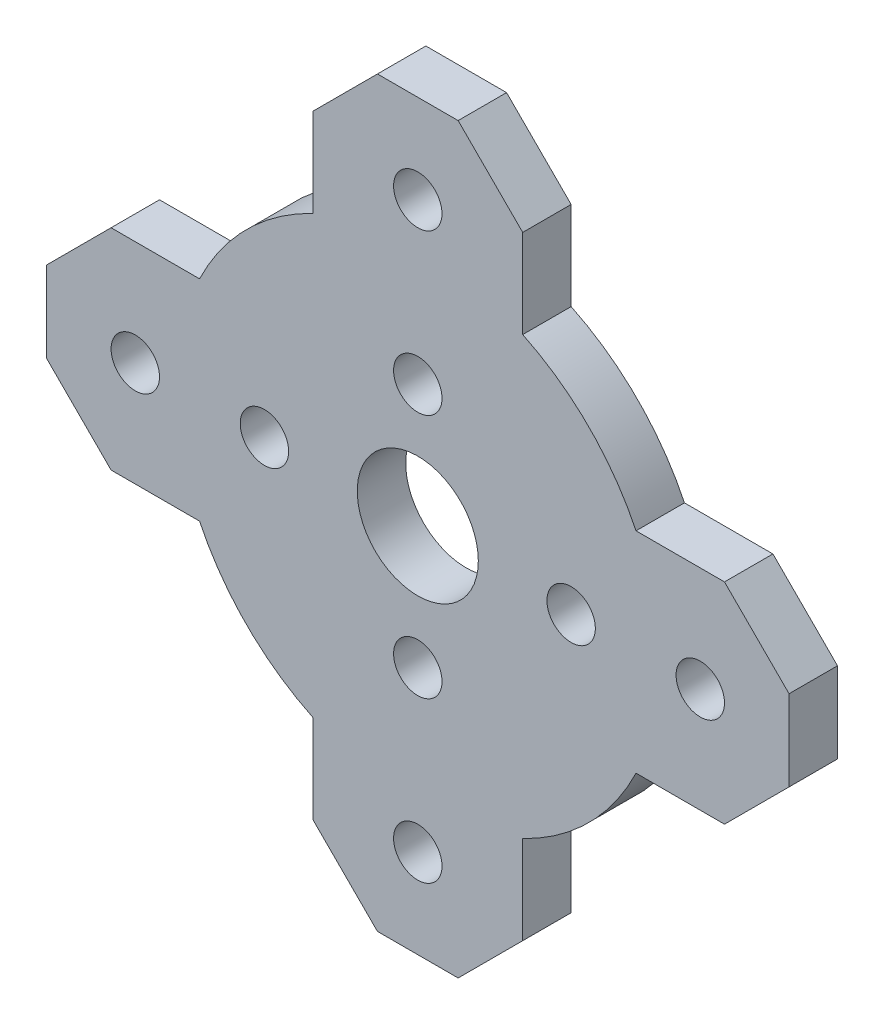
ISO-10303-21;
HEADER;
FILE_DESCRIPTION(('STEP AP214'),'2;1');
FILE_NAME('part.step','',(''),(''),'','','');
FILE_SCHEMA(('AUTOMOTIVE_DESIGN { 1 0 10303 214 1 1 1 1 }'));
ENDSEC;
DATA;
#1=APPLICATION_CONTEXT('core data for automotive mechanical design processes');
#2=APPLICATION_PROTOCOL_DEFINITION('international standard','automotive_design',2000,#1);
#3=PRODUCT_CONTEXT('',#1,'mechanical');
#4=PRODUCT('Part','Part','',(#3));
#5=PRODUCT_RELATED_PRODUCT_CATEGORY('part','',(#4));
#6=PRODUCT_DEFINITION_FORMATION('','',#4);
#7=PRODUCT_DEFINITION_CONTEXT('part definition',#1,'design');
#8=PRODUCT_DEFINITION('design','',#6,#7);
#9=PRODUCT_DEFINITION_SHAPE('','',#8);
#10=(LENGTH_UNIT() NAMED_UNIT(*) SI_UNIT(.MILLI.,.METRE.));
#11=(NAMED_UNIT(*) PLANE_ANGLE_UNIT() SI_UNIT($,.RADIAN.));
#12=(NAMED_UNIT(*) SI_UNIT($,.STERADIAN.) SOLID_ANGLE_UNIT());
#13=UNCERTAINTY_MEASURE_WITH_UNIT(LENGTH_MEASURE(1.E-05),#10,'distance_accuracy_value','');
#14=(GEOMETRIC_REPRESENTATION_CONTEXT(3) GLOBAL_UNCERTAINTY_ASSIGNED_CONTEXT((#13)) GLOBAL_UNIT_ASSIGNED_CONTEXT((#10,
#11,#12)) REPRESENTATION_CONTEXT('',''));
#15=CARTESIAN_POINT('',(0.,0.,0.));
#16=DIRECTION('',(0.,0.,1.));
#17=DIRECTION('',(1.,0.,0.));
#18=AXIS2_PLACEMENT_3D('',#15,#16,#17);
#19=CARTESIAN_POINT('',(0.,0.,3.));
#20=DIRECTION('',(0.,0.,1.));
#21=DIRECTION('',(1.,0.,0.));
#22=AXIS2_PLACEMENT_3D('',#19,#20,#21);
#23=PLANE('',#22);
#24=CARTESIAN_POINT('',(-17.5,0.,3.));
#25=DIRECTION('',(0.,0.,1.));
#26=DIRECTION('',(1.,0.,0.));
#27=AXIS2_PLACEMENT_3D('',#24,#25,#26);
#28=CIRCLE('',#27,1.5);
#29=CARTESIAN_POINT('',(-16.,0.,3.));
#30=VERTEX_POINT('',#29);
#31=EDGE_CURVE('E442',#30,#30,#28,.T.);
#32=ORIENTED_EDGE('',*,*,#31,.F.);
#33=EDGE_LOOP('',(#32));
#34=FACE_BOUND('',#33,.T.);
#35=CARTESIAN_POINT('',(17.5,0.,3.));
#36=DIRECTION('',(0.,0.,1.));
#37=DIRECTION('',(1.,0.,0.));
#38=AXIS2_PLACEMENT_3D('',#35,#36,#37);
#39=CIRCLE('',#38,1.5);
#40=CARTESIAN_POINT('',(19.,0.,3.));
#41=VERTEX_POINT('',#40);
#42=EDGE_CURVE('E430',#41,#41,#39,.T.);
#43=ORIENTED_EDGE('',*,*,#42,.F.);
#44=EDGE_LOOP('',(#43));
#45=FACE_BOUND('',#44,.T.);
#46=CARTESIAN_POINT('',(0.,-7.6,3.));
#47=DIRECTION('',(0.,0.,1.));
#48=DIRECTION('',(1.,0.,0.));
#49=AXIS2_PLACEMENT_3D('',#46,#47,#48);
#50=CIRCLE('',#49,1.5);
#51=CARTESIAN_POINT('',(1.50000000000001,-7.6,3.));
#52=VERTEX_POINT('',#51);
#53=EDGE_CURVE('E418',#52,#52,#50,.T.);
#54=ORIENTED_EDGE('',*,*,#53,.F.);
#55=EDGE_LOOP('',(#54));
#56=FACE_BOUND('',#55,.T.);
#57=CARTESIAN_POINT('',(9.50000000000001,0.,3.));
#58=DIRECTION('',(0.,0.,1.));
#59=DIRECTION('',(1.,0.,0.));
#60=AXIS2_PLACEMENT_3D('',#57,#58,#59);
#61=CIRCLE('',#60,1.5);
#62=CARTESIAN_POINT('',(11.,0.,3.));
#63=VERTEX_POINT('',#62);
#64=EDGE_CURVE('E406',#63,#63,#61,.T.);
#65=ORIENTED_EDGE('',*,*,#64,.F.);
#66=EDGE_LOOP('',(#65));
#67=FACE_BOUND('',#66,.T.);
#68=DIRECTION('',(-1.,0.,0.));
#69=VECTOR('',#68,1.);
#70=CARTESIAN_POINT('',(-23.,6.5,3.));
#71=LINE('',#70,#69);
#72=CARTESIAN_POINT('',(-13.5185058345958,6.5,3.));
#73=VERTEX_POINT('',#72);
#74=CARTESIAN_POINT('',(-19.,6.5,3.));
#75=VERTEX_POINT('',#74);
#76=EDGE_CURVE('E227',#73,#75,#71,.T.);
#77=ORIENTED_EDGE('',*,*,#76,.T.);
#78=DIRECTION('',(0.707106781186549,0.707106781186546,0.));
#79=VECTOR('',#78,1.);
#80=CARTESIAN_POINT('',(-12.75,12.75,3.));
#81=LINE('',#80,#79);
#82=CARTESIAN_POINT('',(-23.,2.50000000000002,3.));
#83=VERTEX_POINT('',#82);
#84=EDGE_CURVE('E351',#75,#83,#81,.F.);
#85=ORIENTED_EDGE('',*,*,#84,.T.);
#86=DIRECTION('',(0.,-1.,0.));
#87=VECTOR('',#86,1.);
#88=CARTESIAN_POINT('',(-23.,6.5,3.));
#89=LINE('',#88,#87);
#90=CARTESIAN_POINT('',(-23.,-2.49999999999999,3.));
#91=VERTEX_POINT('',#90);
#92=EDGE_CURVE('E229',#83,#91,#89,.T.);
#93=ORIENTED_EDGE('',*,*,#92,.T.);
#94=DIRECTION('',(-0.707106781186546,0.707106781186549,0.));
#95=VECTOR('',#94,1.);
#96=CARTESIAN_POINT('',(-12.7500000000001,-12.75,3.));
#97=LINE('',#96,#95);
#98=CARTESIAN_POINT('',(-19.,-6.5,3.));
#99=VERTEX_POINT('',#98);
#100=EDGE_CURVE('E349',#91,#99,#97,.F.);
#101=ORIENTED_EDGE('',*,*,#100,.T.);
#102=DIRECTION('',(1.,0.,0.));
#103=VECTOR('',#102,1.);
#104=CARTESIAN_POINT('',(-23.,-6.5,3.));
#105=LINE('',#104,#103);
#106=CARTESIAN_POINT('',(-13.5185058345958,-6.5,3.));
#107=VERTEX_POINT('',#106);
#108=EDGE_CURVE('E235',#99,#107,#105,.T.);
#109=ORIENTED_EDGE('',*,*,#108,.T.);
#110=CARTESIAN_POINT('',(0.,0.,3.));
#111=DIRECTION('',(0.,0.,1.));
#112=DIRECTION('',(1.,0.,0.));
#113=AXIS2_PLACEMENT_3D('',#110,#111,#112);
#114=CIRCLE('',#113,15.);
#115=CARTESIAN_POINT('',(-6.5,-13.5185058345958,3.));
#116=VERTEX_POINT('',#115);
#117=EDGE_CURVE('E237',#107,#116,#114,.T.);
#118=ORIENTED_EDGE('',*,*,#117,.T.);
#119=DIRECTION('',(0.,-1.,0.));
#120=VECTOR('',#119,1.);
#121=CARTESIAN_POINT('',(-6.5,-23.,3.));
#122=LINE('',#121,#120);
#123=CARTESIAN_POINT('',(-6.5,-19.,3.));
#124=VERTEX_POINT('',#123);
#125=EDGE_CURVE('E239',#116,#124,#122,.T.);
#126=ORIENTED_EDGE('',*,*,#125,.T.);
#127=DIRECTION('',(-0.707106781186546,0.707106781186549,0.));
#128=VECTOR('',#127,1.);
#129=CARTESIAN_POINT('',(-12.75,-12.75,3.));
#130=LINE('',#129,#128);
#131=CARTESIAN_POINT('',(-2.5,-23.,3.));
#132=VERTEX_POINT('',#131);
#133=EDGE_CURVE('E347',#124,#132,#130,.F.);
#134=ORIENTED_EDGE('',*,*,#133,.T.);
#135=DIRECTION('',(1.,0.,0.));
#136=VECTOR('',#135,1.);
#137=CARTESIAN_POINT('',(-6.5,-23.,3.));
#138=LINE('',#137,#136);
#139=CARTESIAN_POINT('',(2.49999999999998,-23.,3.));
#140=VERTEX_POINT('',#139);
#141=EDGE_CURVE('E242',#132,#140,#138,.T.);
#142=ORIENTED_EDGE('',*,*,#141,.T.);
#143=DIRECTION('',(-0.707106781186549,-0.707106781186546,0.));
#144=VECTOR('',#143,1.);
#145=CARTESIAN_POINT('',(12.75,-12.75,3.));
#146=LINE('',#145,#144);
#147=CARTESIAN_POINT('',(6.50000000000001,-19.,3.));
#148=VERTEX_POINT('',#147);
#149=EDGE_CURVE('E345',#140,#148,#146,.F.);
#150=ORIENTED_EDGE('',*,*,#149,.T.);
#151=DIRECTION('',(0.,1.,0.));
#152=VECTOR('',#151,1.);
#153=CARTESIAN_POINT('',(6.50000000000001,-23.,3.));
#154=LINE('',#153,#152);
#155=CARTESIAN_POINT('',(6.50000000000001,-13.5185058345958,3.));
#156=VERTEX_POINT('',#155);
#157=EDGE_CURVE('E245',#148,#156,#154,.T.);
#158=ORIENTED_EDGE('',*,*,#157,.T.);
#159=CARTESIAN_POINT('',(0.,0.,3.));
#160=DIRECTION('',(0.,0.,1.));
#161=DIRECTION('',(1.,0.,0.));
#162=AXIS2_PLACEMENT_3D('',#159,#160,#161);
#163=CIRCLE('',#162,15.);
#164=CARTESIAN_POINT('',(13.5185058345958,-6.5,3.));
#165=VERTEX_POINT('',#164);
#166=EDGE_CURVE('E247',#156,#165,#163,.T.);
#167=ORIENTED_EDGE('',*,*,#166,.T.);
#168=DIRECTION('',(1.,0.,0.));
#169=VECTOR('',#168,1.);
#170=CARTESIAN_POINT('',(23.,-6.5,3.));
#171=LINE('',#170,#169);
#172=CARTESIAN_POINT('',(19.,-6.5,3.));
#173=VERTEX_POINT('',#172);
#174=EDGE_CURVE('E249',#165,#173,#171,.T.);
#175=ORIENTED_EDGE('',*,*,#174,.T.);
#176=DIRECTION('',(-0.707106781186549,-0.707106781186546,0.));
#177=VECTOR('',#176,1.);
#178=CARTESIAN_POINT('',(12.7499999999999,-12.75,3.));
#179=LINE('',#178,#177);
#180=CARTESIAN_POINT('',(23.,-2.50000000000001,3.));
#181=VERTEX_POINT('',#180);
#182=EDGE_CURVE('E343',#173,#181,#179,.F.);
#183=ORIENTED_EDGE('',*,*,#182,.T.);
#184=DIRECTION('',(0.,1.,0.));
#185=VECTOR('',#184,1.);
#186=CARTESIAN_POINT('',(23.,6.5,3.));
#187=LINE('',#186,#185);
#188=CARTESIAN_POINT('',(23.,2.5,3.));
#189=VERTEX_POINT('',#188);
#190=EDGE_CURVE('E252',#181,#189,#187,.T.);
#191=ORIENTED_EDGE('',*,*,#190,.T.);
#192=DIRECTION('',(0.707106781186546,-0.707106781186549,0.));
#193=VECTOR('',#192,1.);
#194=CARTESIAN_POINT('',(12.7500000000001,12.75,3.));
#195=LINE('',#194,#193);
#196=CARTESIAN_POINT('',(19.,6.5,3.));
#197=VERTEX_POINT('',#196);
#198=EDGE_CURVE('E54',#189,#197,#195,.F.);
#199=ORIENTED_EDGE('',*,*,#198,.T.);
#200=DIRECTION('',(-1.,0.,0.));
#201=VECTOR('',#200,1.);
#202=CARTESIAN_POINT('',(23.,6.5,3.));
#203=LINE('',#202,#201);
#204=CARTESIAN_POINT('',(13.5185058345958,6.5,3.));
#205=VERTEX_POINT('',#204);
#206=EDGE_CURVE('E254',#197,#205,#203,.T.);
#207=ORIENTED_EDGE('',*,*,#206,.T.);
#208=CARTESIAN_POINT('',(0.,0.,3.));
#209=DIRECTION('',(0.,0.,1.));
#210=DIRECTION('',(1.,0.,0.));
#211=AXIS2_PLACEMENT_3D('',#208,#209,#210);
#212=CIRCLE('',#211,15.);
#213=CARTESIAN_POINT('',(6.5,13.5185058345958,3.));
#214=VERTEX_POINT('',#213);
#215=EDGE_CURVE('E256',#205,#214,#212,.T.);
#216=ORIENTED_EDGE('',*,*,#215,.T.);
#217=DIRECTION('',(0.,1.,0.));
#218=VECTOR('',#217,1.);
#219=CARTESIAN_POINT('',(6.5,23.,3.));
#220=LINE('',#219,#218);
#221=CARTESIAN_POINT('',(6.5,19.,3.));
#222=VERTEX_POINT('',#221);
#223=EDGE_CURVE('E298',#214,#222,#220,.T.);
#224=ORIENTED_EDGE('',*,*,#223,.T.);
#225=DIRECTION('',(0.707106781186546,-0.707106781186549,0.));
#226=VECTOR('',#225,1.);
#227=CARTESIAN_POINT('',(12.75,12.7499999999999,3.));
#228=LINE('',#227,#226);
#229=CARTESIAN_POINT('',(2.50000000000001,23.,3.));
#230=VERTEX_POINT('',#229);
#231=EDGE_CURVE('E340',#222,#230,#228,.F.);
#232=ORIENTED_EDGE('',*,*,#231,.T.);
#233=DIRECTION('',(-1.,0.,0.));
#234=VECTOR('',#233,1.);
#235=CARTESIAN_POINT('',(-6.5,23.,3.));
#236=LINE('',#235,#234);
#237=CARTESIAN_POINT('',(-2.49999999999999,23.,3.));
#238=VERTEX_POINT('',#237);
#239=EDGE_CURVE('E212',#230,#238,#236,.T.);
#240=ORIENTED_EDGE('',*,*,#239,.T.);
#241=DIRECTION('',(0.707106781186549,0.707106781186546,0.));
#242=VECTOR('',#241,1.);
#243=CARTESIAN_POINT('',(-12.75,12.75,3.));
#244=LINE('',#243,#242);
#245=CARTESIAN_POINT('',(-6.5,19.,3.));
#246=VERTEX_POINT('',#245);
#247=EDGE_CURVE('E209',#238,#246,#244,.F.);
#248=ORIENTED_EDGE('',*,*,#247,.T.);
#249=DIRECTION('',(0.,-1.,0.));
#250=VECTOR('',#249,1.);
#251=CARTESIAN_POINT('',(-6.5,23.,3.));
#252=LINE('',#251,#250);
#253=CARTESIAN_POINT('',(-6.5,13.5185058345958,3.));
#254=VERTEX_POINT('',#253);
#255=EDGE_CURVE('E200',#246,#254,#252,.T.);
#256=ORIENTED_EDGE('',*,*,#255,.T.);
#257=CARTESIAN_POINT('',(0.,0.,3.));
#258=DIRECTION('',(0.,0.,1.));
#259=DIRECTION('',(1.,0.,0.));
#260=AXIS2_PLACEMENT_3D('',#257,#258,#259);
#261=CIRCLE('',#260,15.);
#262=EDGE_CURVE('E205',#254,#73,#261,.T.);
#263=ORIENTED_EDGE('',*,*,#262,.T.);
#264=EDGE_LOOP('',(#77,#85,#93,#101,#109,#118,#126,#134,#142,#150,#158,#167,#175,#183,#191,#199,
#207,#216,#224,#232,#240,#248,#256,#263));
#265=FACE_BOUND('',#264,.T.);
#266=CARTESIAN_POINT('',(0.,7.59999999999999,3.));
#267=DIRECTION('',(0.,0.,1.));
#268=DIRECTION('',(1.,0.,0.));
#269=AXIS2_PLACEMENT_3D('',#266,#267,#268);
#270=CIRCLE('',#269,1.5);
#271=CARTESIAN_POINT('',(1.50000000000001,7.59999999999999,3.));
#272=VERTEX_POINT('',#271);
#273=EDGE_CURVE('E263',#272,#272,#270,.T.);
#274=ORIENTED_EDGE('',*,*,#273,.F.);
#275=EDGE_LOOP('',(#274));
#276=FACE_BOUND('',#275,.T.);
#277=CARTESIAN_POINT('',(-9.5,0.,3.));
#278=DIRECTION('',(0.,0.,1.));
#279=DIRECTION('',(1.,0.,0.));
#280=AXIS2_PLACEMENT_3D('',#277,#278,#279);
#281=CIRCLE('',#280,1.5);
#282=CARTESIAN_POINT('',(-8.,0.,3.));
#283=VERTEX_POINT('',#282);
#284=EDGE_CURVE('E412',#283,#283,#281,.T.);
#285=ORIENTED_EDGE('',*,*,#284,.F.);
#286=EDGE_LOOP('',(#285));
#287=FACE_BOUND('',#286,.T.);
#288=CARTESIAN_POINT('',(0.,17.5,3.));
#289=DIRECTION('',(0.,0.,1.));
#290=DIRECTION('',(1.,0.,0.));
#291=AXIS2_PLACEMENT_3D('',#288,#289,#290);
#292=CIRCLE('',#291,1.5);
#293=CARTESIAN_POINT('',(1.5,17.5,3.));
#294=VERTEX_POINT('',#293);
#295=EDGE_CURVE('E424',#294,#294,#292,.T.);
#296=ORIENTED_EDGE('',*,*,#295,.F.);
#297=EDGE_LOOP('',(#296));
#298=FACE_BOUND('',#297,.T.);
#299=CARTESIAN_POINT('',(0.,-17.5,3.));
#300=DIRECTION('',(0.,0.,1.));
#301=DIRECTION('',(1.,0.,0.));
#302=AXIS2_PLACEMENT_3D('',#299,#300,#301);
#303=CIRCLE('',#302,1.5);
#304=CARTESIAN_POINT('',(1.50000000000001,-17.5,3.));
#305=VERTEX_POINT('',#304);
#306=EDGE_CURVE('E436',#305,#305,#303,.T.);
#307=ORIENTED_EDGE('',*,*,#306,.F.);
#308=EDGE_LOOP('',(#307));
#309=FACE_BOUND('',#308,.T.);
#310=CARTESIAN_POINT('',(0.,0.,3.));
#311=DIRECTION('',(0.,0.,1.));
#312=DIRECTION('',(1.,0.,0.));
#313=AXIS2_PLACEMENT_3D('',#310,#311,#312);
#314=CIRCLE('',#313,3.75);
#315=CARTESIAN_POINT('',(3.75,0.,3.));
#316=VERTEX_POINT('',#315);
#317=EDGE_CURVE('E448',#316,#316,#314,.T.);
#318=ORIENTED_EDGE('',*,*,#317,.F.);
#319=EDGE_LOOP('',(#318));
#320=FACE_BOUND('',#319,.T.);
#321=ADVANCED_FACE('F38',(#34,#45,#56,#67,#265,#276,#287,#298,#309,#320),#23,.T.);
#322=CARTESIAN_POINT('',(0.,0.,0.));
#323=DIRECTION('',(0.,0.,1.));
#324=DIRECTION('',(1.,0.,0.));
#325=AXIS2_PLACEMENT_3D('',#322,#323,#324);
#326=PLANE('',#325);
#327=DIRECTION('',(0.,-1.,0.));
#328=VECTOR('',#327,1.);
#329=CARTESIAN_POINT('',(-23.,6.5,0.));
#330=LINE('',#329,#328);
#331=CARTESIAN_POINT('',(-23.,2.50000000000002,0.));
#332=VERTEX_POINT('',#331);
#333=CARTESIAN_POINT('',(-23.,-2.49999999999999,0.));
#334=VERTEX_POINT('',#333);
#335=EDGE_CURVE('E272',#332,#334,#330,.T.);
#336=ORIENTED_EDGE('',*,*,#335,.F.);
#337=DIRECTION('',(-0.707106781186549,-0.707106781186546,0.));
#338=VECTOR('',#337,1.);
#339=CARTESIAN_POINT('',(-23.,2.50000000000002,0.));
#340=LINE('',#339,#338);
#341=CARTESIAN_POINT('',(-19.,6.5,0.));
#342=VERTEX_POINT('',#341);
#343=EDGE_CURVE('E335',#332,#342,#340,.F.);
#344=ORIENTED_EDGE('',*,*,#343,.T.);
#345=DIRECTION('',(-1.,0.,0.));
#346=VECTOR('',#345,1.);
#347=CARTESIAN_POINT('',(-23.,6.5,0.));
#348=LINE('',#347,#346);
#349=CARTESIAN_POINT('',(-13.5185058345958,6.5,0.));
#350=VERTEX_POINT('',#349);
#351=EDGE_CURVE('E269',#350,#342,#348,.T.);
#352=ORIENTED_EDGE('',*,*,#351,.F.);
#353=CARTESIAN_POINT('',(0.,0.,0.));
#354=DIRECTION('',(0.,0.,1.));
#355=DIRECTION('',(1.,0.,0.));
#356=AXIS2_PLACEMENT_3D('',#353,#354,#355);
#357=CIRCLE('',#356,15.);
#358=CARTESIAN_POINT('',(-6.5,13.5185058345958,0.));
#359=VERTEX_POINT('',#358);
#360=EDGE_CURVE('E267',#359,#350,#357,.T.);
#361=ORIENTED_EDGE('',*,*,#360,.F.);
#362=DIRECTION('',(0.,-1.,0.));
#363=VECTOR('',#362,1.);
#364=CARTESIAN_POINT('',(-6.5,23.,0.));
#365=LINE('',#364,#363);
#366=CARTESIAN_POINT('',(-6.5,19.,0.));
#367=VERTEX_POINT('',#366);
#368=EDGE_CURVE('E218',#367,#359,#365,.T.);
#369=ORIENTED_EDGE('',*,*,#368,.F.);
#370=DIRECTION('',(-0.707106781186549,-0.707106781186546,0.));
#371=VECTOR('',#370,1.);
#372=CARTESIAN_POINT('',(-6.5,19.,0.));
#373=LINE('',#372,#371);
#374=CARTESIAN_POINT('',(-2.49999999999999,23.,0.));
#375=VERTEX_POINT('',#374);
#376=EDGE_CURVE('E321',#367,#375,#373,.F.);
#377=ORIENTED_EDGE('',*,*,#376,.T.);
#378=DIRECTION('',(-1.,0.,0.));
#379=VECTOR('',#378,1.);
#380=CARTESIAN_POINT('',(-6.5,23.,0.));
#381=LINE('',#380,#379);
#382=CARTESIAN_POINT('',(2.50000000000001,23.,0.));
#383=VERTEX_POINT('',#382);
#384=EDGE_CURVE('E262',#383,#375,#381,.T.);
#385=ORIENTED_EDGE('',*,*,#384,.F.);
#386=DIRECTION('',(-0.707106781186546,0.707106781186549,0.));
#387=VECTOR('',#386,1.);
#388=CARTESIAN_POINT('',(2.50000000000002,23.,0.));
#389=LINE('',#388,#387);
#390=CARTESIAN_POINT('',(6.5,19.,0.));
#391=VERTEX_POINT('',#390);
#392=EDGE_CURVE('E323',#383,#391,#389,.F.);
#393=ORIENTED_EDGE('',*,*,#392,.T.);
#394=DIRECTION('',(0.,1.,0.));
#395=VECTOR('',#394,1.);
#396=CARTESIAN_POINT('',(6.5,23.,0.));
#397=LINE('',#396,#395);
#398=CARTESIAN_POINT('',(6.5,13.5185058345958,0.));
#399=VERTEX_POINT('',#398);
#400=EDGE_CURVE('E259',#399,#391,#397,.T.);
#401=ORIENTED_EDGE('',*,*,#400,.F.);
#402=CARTESIAN_POINT('',(0.,0.,0.));
#403=DIRECTION('',(0.,0.,1.));
#404=DIRECTION('',(1.,0.,0.));
#405=AXIS2_PLACEMENT_3D('',#402,#403,#404);
#406=CIRCLE('',#405,15.);
#407=CARTESIAN_POINT('',(13.5185058345958,6.5,0.));
#408=VERTEX_POINT('',#407);
#409=EDGE_CURVE('E296',#408,#399,#406,.T.);
#410=ORIENTED_EDGE('',*,*,#409,.F.);
#411=DIRECTION('',(-1.,0.,0.));
#412=VECTOR('',#411,1.);
#413=CARTESIAN_POINT('',(23.,6.5,0.));
#414=LINE('',#413,#412);
#415=CARTESIAN_POINT('',(19.,6.5,0.));
#416=VERTEX_POINT('',#415);
#417=EDGE_CURVE('E294',#416,#408,#414,.T.);
#418=ORIENTED_EDGE('',*,*,#417,.F.);
#419=DIRECTION('',(-0.707106781186546,0.707106781186549,0.));
#420=VECTOR('',#419,1.);
#421=CARTESIAN_POINT('',(19.,6.5,0.));
#422=LINE('',#421,#420);
#423=CARTESIAN_POINT('',(23.,2.5,0.));
#424=VERTEX_POINT('',#423);
#425=EDGE_CURVE('E325',#416,#424,#422,.F.);
#426=ORIENTED_EDGE('',*,*,#425,.T.);
#427=DIRECTION('',(0.,1.,0.));
#428=VECTOR('',#427,1.);
#429=CARTESIAN_POINT('',(23.,6.5,0.));
#430=LINE('',#429,#428);
#431=CARTESIAN_POINT('',(23.,-2.50000000000001,0.));
#432=VERTEX_POINT('',#431);
#433=EDGE_CURVE('E292',#432,#424,#430,.T.);
#434=ORIENTED_EDGE('',*,*,#433,.F.);
#435=DIRECTION('',(0.707106781186549,0.707106781186546,0.));
#436=VECTOR('',#435,1.);
#437=CARTESIAN_POINT('',(23.,-2.50000000000002,0.));
#438=LINE('',#437,#436);
#439=CARTESIAN_POINT('',(19.,-6.5,0.));
#440=VERTEX_POINT('',#439);
#441=EDGE_CURVE('E327',#432,#440,#438,.F.);
#442=ORIENTED_EDGE('',*,*,#441,.T.);
#443=DIRECTION('',(1.,0.,0.));
#444=VECTOR('',#443,1.);
#445=CARTESIAN_POINT('',(23.,-6.5,0.));
#446=LINE('',#445,#444);
#447=CARTESIAN_POINT('',(13.5185058345958,-6.5,0.));
#448=VERTEX_POINT('',#447);
#449=EDGE_CURVE('E289',#448,#440,#446,.T.);
#450=ORIENTED_EDGE('',*,*,#449,.F.);
#451=CARTESIAN_POINT('',(0.,0.,0.));
#452=DIRECTION('',(0.,0.,1.));
#453=DIRECTION('',(1.,0.,0.));
#454=AXIS2_PLACEMENT_3D('',#451,#452,#453);
#455=CIRCLE('',#454,15.);
#456=CARTESIAN_POINT('',(6.50000000000001,-13.5185058345958,0.));
#457=VERTEX_POINT('',#456);
#458=EDGE_CURVE('E287',#457,#448,#455,.T.);
#459=ORIENTED_EDGE('',*,*,#458,.F.);
#460=DIRECTION('',(0.,1.,0.));
#461=VECTOR('',#460,1.);
#462=CARTESIAN_POINT('',(6.50000000000001,-23.,0.));
#463=LINE('',#462,#461);
#464=CARTESIAN_POINT('',(6.50000000000001,-19.,0.));
#465=VERTEX_POINT('',#464);
#466=EDGE_CURVE('E285',#465,#457,#463,.T.);
#467=ORIENTED_EDGE('',*,*,#466,.F.);
#468=DIRECTION('',(0.707106781186549,0.707106781186546,0.));
#469=VECTOR('',#468,1.);
#470=CARTESIAN_POINT('',(6.50000000000001,-19.,0.));
#471=LINE('',#470,#469);
#472=CARTESIAN_POINT('',(2.49999999999998,-23.,0.));
#473=VERTEX_POINT('',#472);
#474=EDGE_CURVE('E329',#465,#473,#471,.F.);
#475=ORIENTED_EDGE('',*,*,#474,.T.);
#476=DIRECTION('',(1.,0.,0.));
#477=VECTOR('',#476,1.);
#478=CARTESIAN_POINT('',(-6.5,-23.,0.));
#479=LINE('',#478,#477);
#480=CARTESIAN_POINT('',(-2.5,-23.,0.));
#481=VERTEX_POINT('',#480);
#482=EDGE_CURVE('E282',#481,#473,#479,.T.);
#483=ORIENTED_EDGE('',*,*,#482,.F.);
#484=DIRECTION('',(0.707106781186546,-0.707106781186549,0.));
#485=VECTOR('',#484,1.);
#486=CARTESIAN_POINT('',(-2.5,-23.,0.));
#487=LINE('',#486,#485);
#488=CARTESIAN_POINT('',(-6.5,-19.,0.));
#489=VERTEX_POINT('',#488);
#490=EDGE_CURVE('E331',#481,#489,#487,.F.);
#491=ORIENTED_EDGE('',*,*,#490,.T.);
#492=DIRECTION('',(0.,-1.,0.));
#493=VECTOR('',#492,1.);
#494=CARTESIAN_POINT('',(-6.5,-23.,0.));
#495=LINE('',#494,#493);
#496=CARTESIAN_POINT('',(-6.5,-13.5185058345958,0.));
#497=VERTEX_POINT('',#496);
#498=EDGE_CURVE('E279',#497,#489,#495,.T.);
#499=ORIENTED_EDGE('',*,*,#498,.F.);
#500=CARTESIAN_POINT('',(0.,0.,0.));
#501=DIRECTION('',(0.,0.,1.));
#502=DIRECTION('',(1.,0.,0.));
#503=AXIS2_PLACEMENT_3D('',#500,#501,#502);
#504=CIRCLE('',#503,15.);
#505=CARTESIAN_POINT('',(-13.5185058345958,-6.5,0.));
#506=VERTEX_POINT('',#505);
#507=EDGE_CURVE('E277',#506,#497,#504,.T.);
#508=ORIENTED_EDGE('',*,*,#507,.F.);
#509=DIRECTION('',(1.,0.,0.));
#510=VECTOR('',#509,1.);
#511=CARTESIAN_POINT('',(-23.,-6.5,0.));
#512=LINE('',#511,#510);
#513=CARTESIAN_POINT('',(-19.,-6.5,0.));
#514=VERTEX_POINT('',#513);
#515=EDGE_CURVE('E275',#514,#506,#512,.T.);
#516=ORIENTED_EDGE('',*,*,#515,.F.);
#517=DIRECTION('',(0.707106781186546,-0.707106781186549,0.));
#518=VECTOR('',#517,1.);
#519=CARTESIAN_POINT('',(-19.,-6.5,0.));
#520=LINE('',#519,#518);
#521=EDGE_CURVE('E333',#514,#334,#520,.F.);
#522=ORIENTED_EDGE('',*,*,#521,.T.);
#523=EDGE_LOOP('',(#336,#344,#352,#361,#369,#377,#385,#393,#401,#410,#418,#426,#434,#442,#450,
#459,#467,#475,#483,#491,#499,#508,#516,#522));
#524=FACE_BOUND('',#523,.T.);
#525=CARTESIAN_POINT('',(0.,7.59999999999999,0.));
#526=DIRECTION('',(0.,0.,1.));
#527=DIRECTION('',(1.,0.,0.));
#528=AXIS2_PLACEMENT_3D('',#525,#526,#527);
#529=CIRCLE('',#528,1.5);
#530=CARTESIAN_POINT('',(1.50000000000001,7.59999999999999,0.));
#531=VERTEX_POINT('',#530);
#532=EDGE_CURVE('E403',#531,#531,#529,.T.);
#533=ORIENTED_EDGE('',*,*,#532,.T.);
#534=EDGE_LOOP('',(#533));
#535=FACE_BOUND('',#534,.T.);
#536=CARTESIAN_POINT('',(9.50000000000001,0.,0.));
#537=DIRECTION('',(0.,0.,1.));
#538=DIRECTION('',(1.,0.,0.));
#539=AXIS2_PLACEMENT_3D('',#536,#537,#538);
#540=CIRCLE('',#539,1.5);
#541=CARTESIAN_POINT('',(11.,0.,0.));
#542=VERTEX_POINT('',#541);
#543=EDGE_CURVE('E409',#542,#542,#540,.T.);
#544=ORIENTED_EDGE('',*,*,#543,.T.);
#545=EDGE_LOOP('',(#544));
#546=FACE_BOUND('',#545,.T.);
#547=CARTESIAN_POINT('',(-9.5,0.,0.));
#548=DIRECTION('',(0.,0.,1.));
#549=DIRECTION('',(1.,0.,0.));
#550=AXIS2_PLACEMENT_3D('',#547,#548,#549);
#551=CIRCLE('',#550,1.5);
#552=CARTESIAN_POINT('',(-8.,0.,0.));
#553=VERTEX_POINT('',#552);
#554=EDGE_CURVE('E415',#553,#553,#551,.T.);
#555=ORIENTED_EDGE('',*,*,#554,.T.);
#556=EDGE_LOOP('',(#555));
#557=FACE_BOUND('',#556,.T.);
#558=CARTESIAN_POINT('',(0.,-7.6,0.));
#559=DIRECTION('',(0.,0.,1.));
#560=DIRECTION('',(1.,0.,0.));
#561=AXIS2_PLACEMENT_3D('',#558,#559,#560);
#562=CIRCLE('',#561,1.5);
#563=CARTESIAN_POINT('',(1.50000000000001,-7.6,0.));
#564=VERTEX_POINT('',#563);
#565=EDGE_CURVE('E421',#564,#564,#562,.T.);
#566=ORIENTED_EDGE('',*,*,#565,.T.);
#567=EDGE_LOOP('',(#566));
#568=FACE_BOUND('',#567,.T.);
#569=CARTESIAN_POINT('',(0.,17.5,0.));
#570=DIRECTION('',(0.,0.,1.));
#571=DIRECTION('',(1.,0.,0.));
#572=AXIS2_PLACEMENT_3D('',#569,#570,#571);
#573=CIRCLE('',#572,1.5);
#574=CARTESIAN_POINT('',(1.5,17.5,0.));
#575=VERTEX_POINT('',#574);
#576=EDGE_CURVE('E427',#575,#575,#573,.T.);
#577=ORIENTED_EDGE('',*,*,#576,.T.);
#578=EDGE_LOOP('',(#577));
#579=FACE_BOUND('',#578,.T.);
#580=CARTESIAN_POINT('',(17.5,0.,0.));
#581=DIRECTION('',(0.,0.,1.));
#582=DIRECTION('',(1.,0.,0.));
#583=AXIS2_PLACEMENT_3D('',#580,#581,#582);
#584=CIRCLE('',#583,1.5);
#585=CARTESIAN_POINT('',(19.,0.,0.));
#586=VERTEX_POINT('',#585);
#587=EDGE_CURVE('E433',#586,#586,#584,.T.);
#588=ORIENTED_EDGE('',*,*,#587,.T.);
#589=EDGE_LOOP('',(#588));
#590=FACE_BOUND('',#589,.T.);
#591=CARTESIAN_POINT('',(0.,-17.5,0.));
#592=DIRECTION('',(0.,0.,1.));
#593=DIRECTION('',(1.,0.,0.));
#594=AXIS2_PLACEMENT_3D('',#591,#592,#593);
#595=CIRCLE('',#594,1.5);
#596=CARTESIAN_POINT('',(1.50000000000001,-17.5,0.));
#597=VERTEX_POINT('',#596);
#598=EDGE_CURVE('E439',#597,#597,#595,.T.);
#599=ORIENTED_EDGE('',*,*,#598,.T.);
#600=EDGE_LOOP('',(#599));
#601=FACE_BOUND('',#600,.T.);
#602=CARTESIAN_POINT('',(-17.5,0.,0.));
#603=DIRECTION('',(0.,0.,1.));
#604=DIRECTION('',(1.,0.,0.));
#605=AXIS2_PLACEMENT_3D('',#602,#603,#604);
#606=CIRCLE('',#605,1.5);
#607=CARTESIAN_POINT('',(-16.,0.,0.));
#608=VERTEX_POINT('',#607);
#609=EDGE_CURVE('E445',#608,#608,#606,.T.);
#610=ORIENTED_EDGE('',*,*,#609,.T.);
#611=EDGE_LOOP('',(#610));
#612=FACE_BOUND('',#611,.T.);
#613=CARTESIAN_POINT('',(0.,0.,0.));
#614=DIRECTION('',(0.,0.,1.));
#615=DIRECTION('',(1.,0.,0.));
#616=AXIS2_PLACEMENT_3D('',#613,#614,#615);
#617=CIRCLE('',#616,3.75);
#618=CARTESIAN_POINT('',(3.75,0.,0.));
#619=VERTEX_POINT('',#618);
#620=EDGE_CURVE('E451',#619,#619,#617,.T.);
#621=ORIENTED_EDGE('',*,*,#620,.T.);
#622=EDGE_LOOP('',(#621));
#623=FACE_BOUND('',#622,.T.);
#624=ADVANCED_FACE('F399',(#524,#535,#546,#557,#568,#579,#590,#601,#612,#623),#326,.F.);
#625=CARTESIAN_POINT('',(6.5,23.,3.));
#626=DIRECTION('',(-1.,0.,0.));
#627=DIRECTION('',(0.,-1.,0.));
#628=AXIS2_PLACEMENT_3D('',#625,#626,#627);
#629=PLANE('',#628);
#630=ORIENTED_EDGE('',*,*,#400,.T.);
#631=DIRECTION('',(0.,0.,1.));
#632=VECTOR('',#631,1.);
#633=CARTESIAN_POINT('',(6.5,19.,3.));
#634=LINE('',#633,#632);
#635=EDGE_CURVE('E47',#391,#222,#634,.T.);
#636=ORIENTED_EDGE('',*,*,#635,.T.);
#637=ORIENTED_EDGE('',*,*,#223,.F.);
#638=DIRECTION('',(0.,0.,-1.));
#639=VECTOR('',#638,1.);
#640=CARTESIAN_POINT('',(6.5,13.5185058345958,3.));
#641=LINE('',#640,#639);
#642=EDGE_CURVE('E258',#214,#399,#641,.T.);
#643=ORIENTED_EDGE('',*,*,#642,.T.);
#644=EDGE_LOOP('',(#630,#636,#637,#643));
#645=FACE_BOUND('',#644,.T.);
#646=ADVANCED_FACE('F383',(#645),#629,.F.);
#647=CARTESIAN_POINT('',(-6.5,23.,3.));
#648=DIRECTION('',(0.,-1.,0.));
#649=DIRECTION('',(0.,0.,-1.));
#650=AXIS2_PLACEMENT_3D('',#647,#648,#649);
#651=PLANE('',#650);
#652=ORIENTED_EDGE('',*,*,#239,.F.);
#653=DIRECTION('',(0.,0.,-1.));
#654=VECTOR('',#653,1.);
#655=CARTESIAN_POINT('',(2.50000000000002,23.,3.));
#656=LINE('',#655,#654);
#657=EDGE_CURVE('E377',#230,#383,#656,.T.);
#658=ORIENTED_EDGE('',*,*,#657,.T.);
#659=ORIENTED_EDGE('',*,*,#384,.T.);
#660=DIRECTION('',(0.,0.,1.));
#661=VECTOR('',#660,1.);
#662=CARTESIAN_POINT('',(-2.49999999999999,23.,3.));
#663=LINE('',#662,#661);
#664=EDGE_CURVE('E375',#375,#238,#663,.T.);
#665=ORIENTED_EDGE('',*,*,#664,.T.);
#666=EDGE_LOOP('',(#652,#658,#659,#665));
#667=FACE_BOUND('',#666,.T.);
#668=ADVANCED_FACE('F395',(#667),#651,.F.);
#669=CARTESIAN_POINT('',(-6.5,23.,3.));
#670=DIRECTION('',(1.,0.,0.));
#671=DIRECTION('',(0.,1.,0.));
#672=AXIS2_PLACEMENT_3D('',#669,#670,#671);
#673=PLANE('',#672);
#674=ORIENTED_EDGE('',*,*,#255,.F.);
#675=DIRECTION('',(0.,0.,-1.));
#676=VECTOR('',#675,1.);
#677=CARTESIAN_POINT('',(-6.5,19.,3.));
#678=LINE('',#677,#676);
#679=EDGE_CURVE('E11',#246,#367,#678,.T.);
#680=ORIENTED_EDGE('',*,*,#679,.T.);
#681=ORIENTED_EDGE('',*,*,#368,.T.);
#682=DIRECTION('',(0.,0.,-1.));
#683=VECTOR('',#682,1.);
#684=CARTESIAN_POINT('',(-6.5,13.5185058345958,3.));
#685=LINE('',#684,#683);
#686=EDGE_CURVE('E215',#254,#359,#685,.T.);
#687=ORIENTED_EDGE('',*,*,#686,.F.);
#688=EDGE_LOOP('',(#674,#680,#681,#687));
#689=FACE_BOUND('',#688,.T.);
#690=ADVANCED_FACE('F216',(#689),#673,.F.);
#691=CARTESIAN_POINT('',(0.,0.,3.));
#692=DIRECTION('',(0.,0.,-1.));
#693=DIRECTION('',(-1.,0.,0.));
#694=AXIS2_PLACEMENT_3D('',#691,#692,#693);
#695=CYLINDRICAL_SURFACE('',#694,15.);
#696=ORIENTED_EDGE('',*,*,#360,.T.);
#697=DIRECTION('',(0.,0.,-1.));
#698=VECTOR('',#697,1.);
#699=CARTESIAN_POINT('',(-13.5185058345958,6.5,3.));
#700=LINE('',#699,#698);
#701=EDGE_CURVE('E222',#73,#350,#700,.T.);
#702=ORIENTED_EDGE('',*,*,#701,.F.);
#703=ORIENTED_EDGE('',*,*,#262,.F.);
#704=ORIENTED_EDGE('',*,*,#686,.T.);
#705=EDGE_LOOP('',(#696,#702,#703,#704));
#706=FACE_BOUND('',#705,.T.);
#707=ADVANCED_FACE('F224',(#706),#695,.T.);
#708=CARTESIAN_POINT('',(-23.,6.5,3.));
#709=DIRECTION('',(0.,-1.,0.));
#710=DIRECTION('',(0.,0.,-1.));
#711=AXIS2_PLACEMENT_3D('',#708,#709,#710);
#712=PLANE('',#711);
#713=ORIENTED_EDGE('',*,*,#351,.T.);
#714=DIRECTION('',(0.,0.,1.));
#715=VECTOR('',#714,1.);
#716=CARTESIAN_POINT('',(-19.,6.5,3.));
#717=LINE('',#716,#715);
#718=EDGE_CURVE('E337',#342,#75,#717,.T.);
#719=ORIENTED_EDGE('',*,*,#718,.T.);
#720=ORIENTED_EDGE('',*,*,#76,.F.);
#721=ORIENTED_EDGE('',*,*,#701,.T.);
#722=EDGE_LOOP('',(#713,#719,#720,#721));
#723=FACE_BOUND('',#722,.T.);
#724=ADVANCED_FACE('F515',(#723),#712,.F.);
#725=CARTESIAN_POINT('',(-23.,6.5,3.));
#726=DIRECTION('',(1.,0.,0.));
#727=DIRECTION('',(0.,0.,-1.));
#728=AXIS2_PLACEMENT_3D('',#725,#726,#727);
#729=PLANE('',#728);
#730=ORIENTED_EDGE('',*,*,#92,.F.);
#731=DIRECTION('',(0.,0.,-1.));
#732=VECTOR('',#731,1.);
#733=CARTESIAN_POINT('',(-23.,2.50000000000002,3.));
#734=LINE('',#733,#732);
#735=EDGE_CURVE('E318',#83,#332,#734,.T.);
#736=ORIENTED_EDGE('',*,*,#735,.T.);
#737=ORIENTED_EDGE('',*,*,#335,.T.);
#738=DIRECTION('',(0.,0.,1.));
#739=VECTOR('',#738,1.);
#740=CARTESIAN_POINT('',(-23.,-2.5,3.));
#741=LINE('',#740,#739);
#742=EDGE_CURVE('E221',#334,#91,#741,.T.);
#743=ORIENTED_EDGE('',*,*,#742,.T.);
#744=EDGE_LOOP('',(#730,#736,#737,#743));
#745=FACE_BOUND('',#744,.T.);
#746=ADVANCED_FACE('F511',(#745),#729,.F.);
#747=CARTESIAN_POINT('',(-23.,-6.5,3.));
#748=DIRECTION('',(0.,1.,0.));
#749=DIRECTION('',(0.,0.,1.));
#750=AXIS2_PLACEMENT_3D('',#747,#748,#749);
#751=PLANE('',#750);
#752=ORIENTED_EDGE('',*,*,#108,.F.);
#753=DIRECTION('',(0.,0.,-1.));
#754=VECTOR('',#753,1.);
#755=CARTESIAN_POINT('',(-19.,-6.5,3.));
#756=LINE('',#755,#754);
#757=EDGE_CURVE('E353',#99,#514,#756,.T.);
#758=ORIENTED_EDGE('',*,*,#757,.T.);
#759=ORIENTED_EDGE('',*,*,#515,.T.);
#760=DIRECTION('',(0.,0.,-1.));
#761=VECTOR('',#760,1.);
#762=CARTESIAN_POINT('',(-13.5185058345958,-6.5,3.));
#763=LINE('',#762,#761);
#764=EDGE_CURVE('E313',#107,#506,#763,.T.);
#765=ORIENTED_EDGE('',*,*,#764,.F.);
#766=EDGE_LOOP('',(#752,#758,#759,#765));
#767=FACE_BOUND('',#766,.T.);
#768=ADVANCED_FACE('F507',(#767),#751,.F.);
#769=CARTESIAN_POINT('',(0.,0.,3.));
#770=DIRECTION('',(0.,0.,-1.));
#771=DIRECTION('',(-1.,0.,0.));
#772=AXIS2_PLACEMENT_3D('',#769,#770,#771);
#773=CYLINDRICAL_SURFACE('',#772,15.);
#774=ORIENTED_EDGE('',*,*,#507,.T.);
#775=DIRECTION('',(0.,0.,-1.));
#776=VECTOR('',#775,1.);
#777=CARTESIAN_POINT('',(-6.5,-13.5185058345958,3.));
#778=LINE('',#777,#776);
#779=EDGE_CURVE('E310',#116,#497,#778,.T.);
#780=ORIENTED_EDGE('',*,*,#779,.F.);
#781=ORIENTED_EDGE('',*,*,#117,.F.);
#782=ORIENTED_EDGE('',*,*,#764,.T.);
#783=EDGE_LOOP('',(#774,#780,#781,#782));
#784=FACE_BOUND('',#783,.T.);
#785=ADVANCED_FACE('F503',(#784),#773,.T.);
#786=CARTESIAN_POINT('',(-6.5,-23.,3.));
#787=DIRECTION('',(1.,0.,0.));
#788=DIRECTION('',(0.,1.,0.));
#789=AXIS2_PLACEMENT_3D('',#786,#787,#788);
#790=PLANE('',#789);
#791=ORIENTED_EDGE('',*,*,#498,.T.);
#792=DIRECTION('',(0.,0.,1.));
#793=VECTOR('',#792,1.);
#794=CARTESIAN_POINT('',(-6.5,-19.,3.));
#795=LINE('',#794,#793);
#796=EDGE_CURVE('E361',#489,#124,#795,.T.);
#797=ORIENTED_EDGE('',*,*,#796,.T.);
#798=ORIENTED_EDGE('',*,*,#125,.F.);
#799=ORIENTED_EDGE('',*,*,#779,.T.);
#800=EDGE_LOOP('',(#791,#797,#798,#799));
#801=FACE_BOUND('',#800,.T.);
#802=ADVANCED_FACE('F499',(#801),#790,.F.);
#803=CARTESIAN_POINT('',(-6.5,-23.,3.));
#804=DIRECTION('',(0.,1.,0.));
#805=DIRECTION('',(0.,0.,1.));
#806=AXIS2_PLACEMENT_3D('',#803,#804,#805);
#807=PLANE('',#806);
#808=ORIENTED_EDGE('',*,*,#141,.F.);
#809=DIRECTION('',(0.,0.,-1.));
#810=VECTOR('',#809,1.);
#811=CARTESIAN_POINT('',(-2.5,-23.,3.));
#812=LINE('',#811,#810);
#813=EDGE_CURVE('E358',#132,#481,#812,.T.);
#814=ORIENTED_EDGE('',*,*,#813,.T.);
#815=ORIENTED_EDGE('',*,*,#482,.T.);
#816=DIRECTION('',(0.,0.,1.));
#817=VECTOR('',#816,1.);
#818=CARTESIAN_POINT('',(2.49999999999998,-23.,3.));
#819=LINE('',#818,#817);
#820=EDGE_CURVE('E356',#473,#140,#819,.T.);
#821=ORIENTED_EDGE('',*,*,#820,.T.);
#822=EDGE_LOOP('',(#808,#814,#815,#821));
#823=FACE_BOUND('',#822,.T.);
#824=ADVANCED_FACE('F495',(#823),#807,.F.);
#825=CARTESIAN_POINT('',(6.50000000000001,-23.,3.));
#826=DIRECTION('',(-1.,0.,0.));
#827=DIRECTION('',(0.,-1.,0.));
#828=AXIS2_PLACEMENT_3D('',#825,#826,#827);
#829=PLANE('',#828);
#830=ORIENTED_EDGE('',*,*,#157,.F.);
#831=DIRECTION('',(0.,0.,-1.));
#832=VECTOR('',#831,1.);
#833=CARTESIAN_POINT('',(6.50000000000001,-19.,3.));
#834=LINE('',#833,#832);
#835=EDGE_CURVE('E363',#148,#465,#834,.T.);
#836=ORIENTED_EDGE('',*,*,#835,.T.);
#837=ORIENTED_EDGE('',*,*,#466,.T.);
#838=DIRECTION('',(0.,0.,-1.));
#839=VECTOR('',#838,1.);
#840=CARTESIAN_POINT('',(6.50000000000001,-13.5185058345958,3.));
#841=LINE('',#840,#839);
#842=EDGE_CURVE('E307',#156,#457,#841,.T.);
#843=ORIENTED_EDGE('',*,*,#842,.F.);
#844=EDGE_LOOP('',(#830,#836,#837,#843));
#845=FACE_BOUND('',#844,.T.);
#846=ADVANCED_FACE('F491',(#845),#829,.F.);
#847=CARTESIAN_POINT('',(0.,0.,3.));
#848=DIRECTION('',(0.,0.,-1.));
#849=DIRECTION('',(-1.,0.,0.));
#850=AXIS2_PLACEMENT_3D('',#847,#848,#849);
#851=CYLINDRICAL_SURFACE('',#850,15.);
#852=ORIENTED_EDGE('',*,*,#458,.T.);
#853=DIRECTION('',(0.,0.,-1.));
#854=VECTOR('',#853,1.);
#855=CARTESIAN_POINT('',(13.5185058345958,-6.5,3.));
#856=LINE('',#855,#854);
#857=EDGE_CURVE('E304',#165,#448,#856,.T.);
#858=ORIENTED_EDGE('',*,*,#857,.F.);
#859=ORIENTED_EDGE('',*,*,#166,.F.);
#860=ORIENTED_EDGE('',*,*,#842,.T.);
#861=EDGE_LOOP('',(#852,#858,#859,#860));
#862=FACE_BOUND('',#861,.T.);
#863=ADVANCED_FACE('F487',(#862),#851,.T.);
#864=CARTESIAN_POINT('',(23.,-6.5,3.));
#865=DIRECTION('',(0.,1.,0.));
#866=DIRECTION('',(0.,0.,1.));
#867=AXIS2_PLACEMENT_3D('',#864,#865,#866);
#868=PLANE('',#867);
#869=ORIENTED_EDGE('',*,*,#449,.T.);
#870=DIRECTION('',(0.,0.,1.));
#871=VECTOR('',#870,1.);
#872=CARTESIAN_POINT('',(19.,-6.5,3.));
#873=LINE('',#872,#871);
#874=EDGE_CURVE('E370',#440,#173,#873,.T.);
#875=ORIENTED_EDGE('',*,*,#874,.T.);
#876=ORIENTED_EDGE('',*,*,#174,.F.);
#877=ORIENTED_EDGE('',*,*,#857,.T.);
#878=EDGE_LOOP('',(#869,#875,#876,#877));
#879=FACE_BOUND('',#878,.T.);
#880=ADVANCED_FACE('F484',(#879),#868,.F.);
#881=CARTESIAN_POINT('',(23.,6.5,3.));
#882=DIRECTION('',(-1.,0.,0.));
#883=DIRECTION('',(0.,0.,1.));
#884=AXIS2_PLACEMENT_3D('',#881,#882,#883);
#885=PLANE('',#884);
#886=ORIENTED_EDGE('',*,*,#190,.F.);
#887=DIRECTION('',(0.,0.,-1.));
#888=VECTOR('',#887,1.);
#889=CARTESIAN_POINT('',(23.,-2.50000000000002,3.));
#890=LINE('',#889,#888);
#891=EDGE_CURVE('E367',#181,#432,#890,.T.);
#892=ORIENTED_EDGE('',*,*,#891,.T.);
#893=ORIENTED_EDGE('',*,*,#433,.T.);
#894=DIRECTION('',(0.,0.,1.));
#895=VECTOR('',#894,1.);
#896=CARTESIAN_POINT('',(23.,2.5,3.));
#897=LINE('',#896,#895);
#898=EDGE_CURVE('E62',#424,#189,#897,.T.);
#899=ORIENTED_EDGE('',*,*,#898,.T.);
#900=EDGE_LOOP('',(#886,#892,#893,#899));
#901=FACE_BOUND('',#900,.T.);
#902=ADVANCED_FACE('F480',(#901),#885,.F.);
#903=CARTESIAN_POINT('',(23.,6.5,3.));
#904=DIRECTION('',(0.,-1.,0.));
#905=DIRECTION('',(0.,0.,-1.));
#906=AXIS2_PLACEMENT_3D('',#903,#904,#905);
#907=PLANE('',#906);
#908=ORIENTED_EDGE('',*,*,#206,.F.);
#909=DIRECTION('',(0.,0.,-1.));
#910=VECTOR('',#909,1.);
#911=CARTESIAN_POINT('',(19.,6.5,3.));
#912=LINE('',#911,#910);
#913=EDGE_CURVE('E372',#197,#416,#912,.T.);
#914=ORIENTED_EDGE('',*,*,#913,.T.);
#915=ORIENTED_EDGE('',*,*,#417,.T.);
#916=DIRECTION('',(0.,0.,-1.));
#917=VECTOR('',#916,1.);
#918=CARTESIAN_POINT('',(13.5185058345958,6.5,3.));
#919=LINE('',#918,#917);
#920=EDGE_CURVE('E301',#205,#408,#919,.T.);
#921=ORIENTED_EDGE('',*,*,#920,.F.);
#922=EDGE_LOOP('',(#908,#914,#915,#921));
#923=FACE_BOUND('',#922,.T.);
#924=ADVANCED_FACE('F476',(#923),#907,.F.);
#925=CARTESIAN_POINT('',(0.,0.,3.));
#926=DIRECTION('',(0.,0.,-1.));
#927=DIRECTION('',(-1.,0.,0.));
#928=AXIS2_PLACEMENT_3D('',#925,#926,#927);
#929=CYLINDRICAL_SURFACE('',#928,15.);
#930=ORIENTED_EDGE('',*,*,#409,.T.);
#931=ORIENTED_EDGE('',*,*,#642,.F.);
#932=ORIENTED_EDGE('',*,*,#215,.F.);
#933=ORIENTED_EDGE('',*,*,#920,.T.);
#934=EDGE_LOOP('',(#930,#931,#932,#933));
#935=FACE_BOUND('',#934,.T.);
#936=ADVANCED_FACE('F473',(#935),#929,.T.);
#937=CARTESIAN_POINT('',(0.,7.59999999999999,3.));
#938=DIRECTION('',(0.,0.,-1.));
#939=DIRECTION('',(-1.,0.,0.));
#940=AXIS2_PLACEMENT_3D('',#937,#938,#939);
#941=CYLINDRICAL_SURFACE('',#940,1.5);
#942=ORIENTED_EDGE('',*,*,#273,.T.);
#943=EDGE_LOOP('',(#942));
#944=FACE_BOUND('',#943,.T.);
#945=ORIENTED_EDGE('',*,*,#532,.F.);
#946=EDGE_LOOP('',(#945));
#947=FACE_BOUND('',#946,.T.);
#948=ADVANCED_FACE('F470',(#944,#947),#941,.F.);
#949=CARTESIAN_POINT('',(9.50000000000001,0.,3.));
#950=DIRECTION('',(0.,0.,-1.));
#951=DIRECTION('',(-1.,0.,0.));
#952=AXIS2_PLACEMENT_3D('',#949,#950,#951);
#953=CYLINDRICAL_SURFACE('',#952,1.5);
#954=ORIENTED_EDGE('',*,*,#64,.T.);
#955=EDGE_LOOP('',(#954));
#956=FACE_BOUND('',#955,.T.);
#957=ORIENTED_EDGE('',*,*,#543,.F.);
#958=EDGE_LOOP('',(#957));
#959=FACE_BOUND('',#958,.T.);
#960=ADVANCED_FACE('F772',(#956,#959),#953,.F.);
#961=CARTESIAN_POINT('',(-9.5,0.,3.));
#962=DIRECTION('',(0.,0.,-1.));
#963=DIRECTION('',(-1.,0.,0.));
#964=AXIS2_PLACEMENT_3D('',#961,#962,#963);
#965=CYLINDRICAL_SURFACE('',#964,1.5);
#966=ORIENTED_EDGE('',*,*,#284,.T.);
#967=EDGE_LOOP('',(#966));
#968=FACE_BOUND('',#967,.T.);
#969=ORIENTED_EDGE('',*,*,#554,.F.);
#970=EDGE_LOOP('',(#969));
#971=FACE_BOUND('',#970,.T.);
#972=ADVANCED_FACE('F762',(#968,#971),#965,.F.);
#973=CARTESIAN_POINT('',(0.,-7.6,3.));
#974=DIRECTION('',(0.,0.,-1.));
#975=DIRECTION('',(-1.,0.,0.));
#976=AXIS2_PLACEMENT_3D('',#973,#974,#975);
#977=CYLINDRICAL_SURFACE('',#976,1.5);
#978=ORIENTED_EDGE('',*,*,#53,.T.);
#979=EDGE_LOOP('',(#978));
#980=FACE_BOUND('',#979,.T.);
#981=ORIENTED_EDGE('',*,*,#565,.F.);
#982=EDGE_LOOP('',(#981));
#983=FACE_BOUND('',#982,.T.);
#984=ADVANCED_FACE('F752',(#980,#983),#977,.F.);
#985=CARTESIAN_POINT('',(0.,17.5,3.));
#986=DIRECTION('',(0.,0.,-1.));
#987=DIRECTION('',(-1.,0.,0.));
#988=AXIS2_PLACEMENT_3D('',#985,#986,#987);
#989=CYLINDRICAL_SURFACE('',#988,1.5);
#990=ORIENTED_EDGE('',*,*,#295,.T.);
#991=EDGE_LOOP('',(#990));
#992=FACE_BOUND('',#991,.T.);
#993=ORIENTED_EDGE('',*,*,#576,.F.);
#994=EDGE_LOOP('',(#993));
#995=FACE_BOUND('',#994,.T.);
#996=ADVANCED_FACE('F742',(#992,#995),#989,.F.);
#997=CARTESIAN_POINT('',(17.5,0.,3.));
#998=DIRECTION('',(0.,0.,-1.));
#999=DIRECTION('',(-1.,0.,0.));
#1000=AXIS2_PLACEMENT_3D('',#997,#998,#999);
#1001=CYLINDRICAL_SURFACE('',#1000,1.5);
#1002=ORIENTED_EDGE('',*,*,#42,.T.);
#1003=EDGE_LOOP('',(#1002));
#1004=FACE_BOUND('',#1003,.T.);
#1005=ORIENTED_EDGE('',*,*,#587,.F.);
#1006=EDGE_LOOP('',(#1005));
#1007=FACE_BOUND('',#1006,.T.);
#1008=ADVANCED_FACE('F732',(#1004,#1007),#1001,.F.);
#1009=CARTESIAN_POINT('',(0.,-17.5,3.));
#1010=DIRECTION('',(0.,0.,-1.));
#1011=DIRECTION('',(-1.,0.,0.));
#1012=AXIS2_PLACEMENT_3D('',#1009,#1010,#1011);
#1013=CYLINDRICAL_SURFACE('',#1012,1.5);
#1014=ORIENTED_EDGE('',*,*,#306,.T.);
#1015=EDGE_LOOP('',(#1014));
#1016=FACE_BOUND('',#1015,.T.);
#1017=ORIENTED_EDGE('',*,*,#598,.F.);
#1018=EDGE_LOOP('',(#1017));
#1019=FACE_BOUND('',#1018,.T.);
#1020=ADVANCED_FACE('F722',(#1016,#1019),#1013,.F.);
#1021=CARTESIAN_POINT('',(-17.5,0.,3.));
#1022=DIRECTION('',(0.,0.,-1.));
#1023=DIRECTION('',(-1.,0.,0.));
#1024=AXIS2_PLACEMENT_3D('',#1021,#1022,#1023);
#1025=CYLINDRICAL_SURFACE('',#1024,1.5);
#1026=ORIENTED_EDGE('',*,*,#31,.T.);
#1027=EDGE_LOOP('',(#1026));
#1028=FACE_BOUND('',#1027,.T.);
#1029=ORIENTED_EDGE('',*,*,#609,.F.);
#1030=EDGE_LOOP('',(#1029));
#1031=FACE_BOUND('',#1030,.T.);
#1032=ADVANCED_FACE('F713',(#1028,#1031),#1025,.F.);
#1033=CARTESIAN_POINT('',(0.,0.,3.));
#1034=DIRECTION('',(0.,0.,-1.));
#1035=DIRECTION('',(-1.,0.,0.));
#1036=AXIS2_PLACEMENT_3D('',#1033,#1034,#1035);
#1037=CYLINDRICAL_SURFACE('',#1036,3.75);
#1038=ORIENTED_EDGE('',*,*,#317,.T.);
#1039=EDGE_LOOP('',(#1038));
#1040=FACE_BOUND('',#1039,.T.);
#1041=ORIENTED_EDGE('',*,*,#620,.F.);
#1042=EDGE_LOOP('',(#1041));
#1043=FACE_BOUND('',#1042,.T.);
#1044=ADVANCED_FACE('F457',(#1040,#1043),#1037,.F.);
#1045=CARTESIAN_POINT('',(-23.,2.50000000000002,3.));
#1046=DIRECTION('',(0.707106781186546,-0.707106781186549,0.));
#1047=DIRECTION('',(0.,0.,-1.));
#1048=AXIS2_PLACEMENT_3D('',#1045,#1046,#1047);
#1049=PLANE('',#1048);
#1050=ORIENTED_EDGE('',*,*,#84,.F.);
#1051=ORIENTED_EDGE('',*,*,#718,.F.);
#1052=ORIENTED_EDGE('',*,*,#343,.F.);
#1053=ORIENTED_EDGE('',*,*,#735,.F.);
#1054=EDGE_LOOP('',(#1050,#1051,#1052,#1053));
#1055=FACE_BOUND('',#1054,.T.);
#1056=ADVANCED_FACE('F529',(#1055),#1049,.F.);
#1057=CARTESIAN_POINT('',(-19.,-6.5,3.));
#1058=DIRECTION('',(0.707106781186549,0.707106781186546,0.));
#1059=DIRECTION('',(0.,0.,-1.));
#1060=AXIS2_PLACEMENT_3D('',#1057,#1058,#1059);
#1061=PLANE('',#1060);
#1062=ORIENTED_EDGE('',*,*,#100,.F.);
#1063=ORIENTED_EDGE('',*,*,#742,.F.);
#1064=ORIENTED_EDGE('',*,*,#521,.F.);
#1065=ORIENTED_EDGE('',*,*,#757,.F.);
#1066=EDGE_LOOP('',(#1062,#1063,#1064,#1065));
#1067=FACE_BOUND('',#1066,.T.);
#1068=ADVANCED_FACE('F535',(#1067),#1061,.F.);
#1069=CARTESIAN_POINT('',(-2.5,-23.,3.));
#1070=DIRECTION('',(0.707106781186549,0.707106781186546,0.));
#1071=DIRECTION('',(0.,0.,-1.));
#1072=AXIS2_PLACEMENT_3D('',#1069,#1070,#1071);
#1073=PLANE('',#1072);
#1074=ORIENTED_EDGE('',*,*,#133,.F.);
#1075=ORIENTED_EDGE('',*,*,#796,.F.);
#1076=ORIENTED_EDGE('',*,*,#490,.F.);
#1077=ORIENTED_EDGE('',*,*,#813,.F.);
#1078=EDGE_LOOP('',(#1074,#1075,#1076,#1077));
#1079=FACE_BOUND('',#1078,.T.);
#1080=ADVANCED_FACE('F542',(#1079),#1073,.F.);
#1081=CARTESIAN_POINT('',(6.50000000000001,-19.,3.));
#1082=DIRECTION('',(-0.707106781186546,0.707106781186549,0.));
#1083=DIRECTION('',(0.,0.,-1.));
#1084=AXIS2_PLACEMENT_3D('',#1081,#1082,#1083);
#1085=PLANE('',#1084);
#1086=ORIENTED_EDGE('',*,*,#149,.F.);
#1087=ORIENTED_EDGE('',*,*,#820,.F.);
#1088=ORIENTED_EDGE('',*,*,#474,.F.);
#1089=ORIENTED_EDGE('',*,*,#835,.F.);
#1090=EDGE_LOOP('',(#1086,#1087,#1088,#1089));
#1091=FACE_BOUND('',#1090,.T.);
#1092=ADVANCED_FACE('F549',(#1091),#1085,.F.);
#1093=CARTESIAN_POINT('',(23.,-2.50000000000002,3.));
#1094=DIRECTION('',(-0.707106781186546,0.707106781186549,0.));
#1095=DIRECTION('',(0.,0.,-1.));
#1096=AXIS2_PLACEMENT_3D('',#1093,#1094,#1095);
#1097=PLANE('',#1096);
#1098=ORIENTED_EDGE('',*,*,#182,.F.);
#1099=ORIENTED_EDGE('',*,*,#874,.F.);
#1100=ORIENTED_EDGE('',*,*,#441,.F.);
#1101=ORIENTED_EDGE('',*,*,#891,.F.);
#1102=EDGE_LOOP('',(#1098,#1099,#1100,#1101));
#1103=FACE_BOUND('',#1102,.T.);
#1104=ADVANCED_FACE('F556',(#1103),#1097,.F.);
#1105=CARTESIAN_POINT('',(19.,6.5,3.));
#1106=DIRECTION('',(-0.707106781186549,-0.707106781186546,0.));
#1107=DIRECTION('',(0.,0.,-1.));
#1108=AXIS2_PLACEMENT_3D('',#1105,#1106,#1107);
#1109=PLANE('',#1108);
#1110=ORIENTED_EDGE('',*,*,#198,.F.);
#1111=ORIENTED_EDGE('',*,*,#898,.F.);
#1112=ORIENTED_EDGE('',*,*,#425,.F.);
#1113=ORIENTED_EDGE('',*,*,#913,.F.);
#1114=EDGE_LOOP('',(#1110,#1111,#1112,#1113));
#1115=FACE_BOUND('',#1114,.T.);
#1116=ADVANCED_FACE('F563',(#1115),#1109,.F.);
#1117=CARTESIAN_POINT('',(2.50000000000002,23.,3.));
#1118=DIRECTION('',(-0.707106781186549,-0.707106781186546,0.));
#1119=DIRECTION('',(0.,0.,-1.));
#1120=AXIS2_PLACEMENT_3D('',#1117,#1118,#1119);
#1121=PLANE('',#1120);
#1122=ORIENTED_EDGE('',*,*,#231,.F.);
#1123=ORIENTED_EDGE('',*,*,#635,.F.);
#1124=ORIENTED_EDGE('',*,*,#392,.F.);
#1125=ORIENTED_EDGE('',*,*,#657,.F.);
#1126=EDGE_LOOP('',(#1122,#1123,#1124,#1125));
#1127=FACE_BOUND('',#1126,.T.);
#1128=ADVANCED_FACE('F392',(#1127),#1121,.F.);
#1129=CARTESIAN_POINT('',(-6.5,19.,3.));
#1130=DIRECTION('',(0.707106781186546,-0.707106781186549,0.));
#1131=DIRECTION('',(0.,0.,-1.));
#1132=AXIS2_PLACEMENT_3D('',#1129,#1130,#1131);
#1133=PLANE('',#1132);
#1134=ORIENTED_EDGE('',*,*,#247,.F.);
#1135=ORIENTED_EDGE('',*,*,#664,.F.);
#1136=ORIENTED_EDGE('',*,*,#376,.F.);
#1137=ORIENTED_EDGE('',*,*,#679,.F.);
#1138=EDGE_LOOP('',(#1134,#1135,#1136,#1137));
#1139=FACE_BOUND('',#1138,.T.);
#1140=ADVANCED_FACE('F41',(#1139),#1133,.F.);
#1141=CLOSED_SHELL('',(#321,#624,#646,#668,#690,#707,#724,#746,#768,#785,#802,#824,#846,#863,
#880,#902,#924,#936,#948,#960,#972,#984,#996,#1008,#1020,#1032,#1044,#1056,#1068,#1080,#1092,
#1104,#1116,#1128,#1140));
#1142=MANIFOLD_SOLID_BREP('B2',#1141);
#1143=ADVANCED_BREP_SHAPE_REPRESENTATION('',(#18,#1142),#14);
#1144=SHAPE_DEFINITION_REPRESENTATION(#9,#1143);
ENDSEC;
END-ISO-10303-21;
